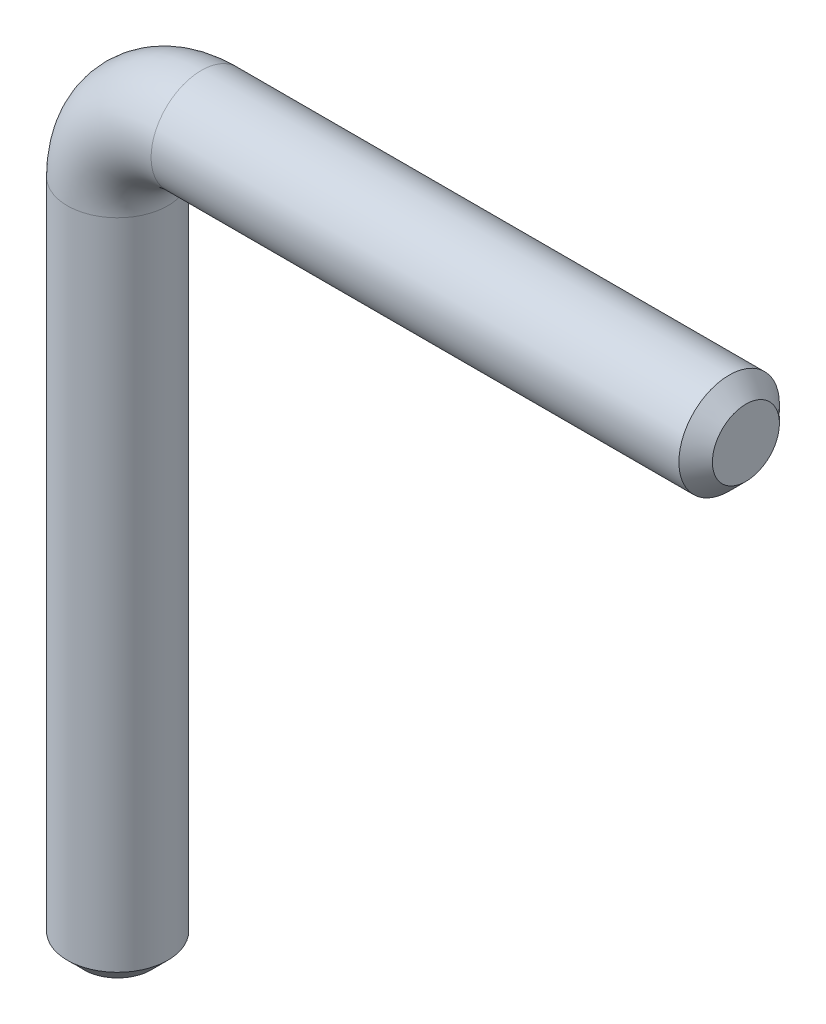
ISO-10303-21;
HEADER;
FILE_DESCRIPTION(('STEP AP214'),'2;1');
FILE_NAME('part.step','',(''),(''),'','','');
FILE_SCHEMA(('AUTOMOTIVE_DESIGN { 1 0 10303 214 1 1 1 1 }'));
ENDSEC;
DATA;
#1=APPLICATION_CONTEXT('core data for automotive mechanical design processes');
#2=APPLICATION_PROTOCOL_DEFINITION('international standard','automotive_design',2000,#1);
#3=PRODUCT_CONTEXT('',#1,'mechanical');
#4=PRODUCT('Part','Part','',(#3));
#5=PRODUCT_RELATED_PRODUCT_CATEGORY('part','',(#4));
#6=PRODUCT_DEFINITION_FORMATION('','',#4);
#7=PRODUCT_DEFINITION_CONTEXT('part definition',#1,'design');
#8=PRODUCT_DEFINITION('design','',#6,#7);
#9=PRODUCT_DEFINITION_SHAPE('','',#8);
#10=(LENGTH_UNIT() NAMED_UNIT(*) SI_UNIT(.MILLI.,.METRE.));
#11=(NAMED_UNIT(*) PLANE_ANGLE_UNIT() SI_UNIT($,.RADIAN.));
#12=(NAMED_UNIT(*) SI_UNIT($,.STERADIAN.) SOLID_ANGLE_UNIT());
#13=UNCERTAINTY_MEASURE_WITH_UNIT(LENGTH_MEASURE(1.E-05),#10,'distance_accuracy_value','');
#14=(GEOMETRIC_REPRESENTATION_CONTEXT(3) GLOBAL_UNCERTAINTY_ASSIGNED_CONTEXT((#13)) GLOBAL_UNIT_ASSIGNED_CONTEXT((#10,
#11,#12)) REPRESENTATION_CONTEXT('',''));
#15=CARTESIAN_POINT('',(0.,0.,0.));
#16=DIRECTION('',(0.,0.,1.));
#17=DIRECTION('',(1.,0.,0.));
#18=AXIS2_PLACEMENT_3D('',#15,#16,#17);
#19=CARTESIAN_POINT('',(75.,90.,0.));
#20=DIRECTION('',(1.,0.,0.));
#21=DIRECTION('',(0.,1.,0.));
#22=AXIS2_PLACEMENT_3D('',#19,#20,#21);
#23=PLANE('',#22);
#24=CARTESIAN_POINT('',(75.,90.,0.));
#25=DIRECTION('',(1.,0.,0.));
#26=DIRECTION('',(0.,1.,0.));
#27=AXIS2_PLACEMENT_3D('',#24,#25,#26);
#28=CIRCLE('',#27,3.99999999999999);
#29=CARTESIAN_POINT('',(75.,94.,0.));
#30=VERTEX_POINT('',#29);
#31=EDGE_CURVE('E80',#30,#30,#28,.T.);
#32=ORIENTED_EDGE('',*,*,#31,.T.);
#33=EDGE_LOOP('',(#32));
#34=FACE_BOUND('',#33,.T.);
#35=ADVANCED_FACE('F64',(#34),#23,.T.);
#36=CARTESIAN_POINT('',(0.,0.,0.));
#37=DIRECTION('',(0.,1.,0.));
#38=DIRECTION('',(-1.,0.,0.));
#39=AXIS2_PLACEMENT_3D('',#36,#37,#38);
#40=PLANE('',#39);
#41=CARTESIAN_POINT('',(0.,0.,0.));
#42=DIRECTION('',(0.,1.,0.));
#43=DIRECTION('',(-1.,0.,0.));
#44=AXIS2_PLACEMENT_3D('',#41,#42,#43);
#45=CIRCLE('',#44,3.99999999999999);
#46=CARTESIAN_POINT('',(-3.99999999999999,0.,0.));
#47=VERTEX_POINT('',#46);
#48=EDGE_CURVE('E13',#47,#47,#45,.F.);
#49=ORIENTED_EDGE('',*,*,#48,.T.);
#50=EDGE_LOOP('',(#49));
#51=FACE_BOUND('',#50,.T.);
#52=ADVANCED_FACE('F105',(#51),#40,.F.);
#53=CARTESIAN_POINT('',(75.,90.,0.));
#54=DIRECTION('',(-1.,0.,0.));
#55=DIRECTION('',(0.,-1.,0.));
#56=AXIS2_PLACEMENT_3D('',#53,#54,#55);
#57=CYLINDRICAL_SURFACE('',#56,6.);
#58=CARTESIAN_POINT('',(73.,90.,0.));
#59=DIRECTION('',(1.,0.,0.));
#60=DIRECTION('',(0.,0.,-1.));
#61=AXIS2_PLACEMENT_3D('',#58,#59,#60);
#62=CIRCLE('',#61,6.);
#63=CARTESIAN_POINT('',(73.,90.,-6.));
#64=VERTEX_POINT('',#63);
#65=EDGE_CURVE('E76',#64,#64,#62,.F.);
#66=ORIENTED_EDGE('',*,*,#65,.T.);
#67=EDGE_LOOP('',(#66));
#68=FACE_BOUND('',#67,.T.);
#69=CARTESIAN_POINT('',(9.99999999999999,90.,0.));
#70=DIRECTION('',(1.,0.,0.));
#71=DIRECTION('',(0.,1.,0.));
#72=AXIS2_PLACEMENT_3D('',#69,#70,#71);
#73=CIRCLE('',#72,6.);
#74=CARTESIAN_POINT('',(9.99999999999999,96.,0.));
#75=VERTEX_POINT('',#74);
#76=EDGE_CURVE('E88',#75,#75,#73,.T.);
#77=ORIENTED_EDGE('',*,*,#76,.T.);
#78=EDGE_LOOP('',(#77));
#79=FACE_BOUND('',#78,.T.);
#80=ADVANCED_FACE('F92',(#68,#79),#57,.T.);
#81=CARTESIAN_POINT('',(9.99999999999999,80.,0.));
#82=DIRECTION('',(0.,0.,1.));
#83=DIRECTION('',(1.,0.,0.));
#84=AXIS2_PLACEMENT_3D('',#81,#82,#83);
#85=TOROIDAL_SURFACE('',#84,9.99999999999999,6.);
#86=CARTESIAN_POINT('',(0.,80.,0.));
#87=DIRECTION('',(0.,1.,0.));
#88=DIRECTION('',(-1.,0.,0.));
#89=AXIS2_PLACEMENT_3D('',#86,#87,#88);
#90=CIRCLE('',#89,6.);
#91=CARTESIAN_POINT('',(-5.99999999999999,80.,0.));
#92=VERTEX_POINT('',#91);
#93=EDGE_CURVE('E85',#92,#92,#90,.T.);
#94=CARTESIAN_POINT('',(9.99999999999999,80.,0.));
#95=DIRECTION('',(0.,0.,1.));
#96=DIRECTION('',(1.,0.,0.));
#97=AXIS2_PLACEMENT_3D('',#94,#95,#96);
#98=CIRCLE('',#97,16.);
#99=EDGE_CURVE('',#75,#92,#98,.T.);
#100=ORIENTED_EDGE('',*,*,#76,.F.);
#101=ORIENTED_EDGE('',*,*,#93,.T.);
#102=ORIENTED_EDGE('',*,*,#99,.T.);
#103=ORIENTED_EDGE('',*,*,#99,.F.);
#104=EDGE_LOOP('',(#100,#102,#101,#103));
#105=FACE_BOUND('',#104,.T.);
#106=ADVANCED_FACE('F94',(#105),#85,.T.);
#107=CARTESIAN_POINT('',(0.,80.,0.));
#108=DIRECTION('',(0.,-1.,0.));
#109=DIRECTION('',(1.,0.,0.));
#110=AXIS2_PLACEMENT_3D('',#107,#108,#109);
#111=CYLINDRICAL_SURFACE('',#110,6.);
#112=CARTESIAN_POINT('',(0.,2.,0.));
#113=DIRECTION('',(0.,1.,0.));
#114=DIRECTION('',(-1.,0.,0.));
#115=AXIS2_PLACEMENT_3D('',#112,#113,#114);
#116=CIRCLE('',#115,6.);
#117=CARTESIAN_POINT('',(-6.,2.,0.));
#118=VERTEX_POINT('',#117);
#119=EDGE_CURVE('E72',#118,#118,#116,.T.);
#120=ORIENTED_EDGE('',*,*,#119,.T.);
#121=EDGE_LOOP('',(#120));
#122=FACE_BOUND('',#121,.T.);
#123=ORIENTED_EDGE('',*,*,#93,.F.);
#124=EDGE_LOOP('',(#123));
#125=FACE_BOUND('',#124,.T.);
#126=ADVANCED_FACE('F96',(#122,#125),#111,.T.);
#127=CARTESIAN_POINT('',(75.,90.,0.));
#128=DIRECTION('',(-1.,0.,0.));
#129=DIRECTION('',(0.,0.,1.));
#130=AXIS2_PLACEMENT_3D('',#127,#128,#129);
#131=CONICAL_SURFACE('',#130,3.99999999999999,0.785398163397454);
#132=ORIENTED_EDGE('',*,*,#65,.F.);
#133=EDGE_LOOP('',(#132));
#134=FACE_BOUND('',#133,.T.);
#135=ORIENTED_EDGE('',*,*,#31,.F.);
#136=EDGE_LOOP('',(#135));
#137=FACE_BOUND('',#136,.T.);
#138=ADVANCED_FACE('F103',(#134,#137),#131,.T.);
#139=CARTESIAN_POINT('',(0.,2.,0.));
#140=DIRECTION('',(0.,1.,0.));
#141=DIRECTION('',(-1.,0.,0.));
#142=AXIS2_PLACEMENT_3D('',#139,#140,#141);
#143=CONICAL_SURFACE('',#142,6.,0.78539816339745);
#144=ORIENTED_EDGE('',*,*,#48,.F.);
#145=EDGE_LOOP('',(#144));
#146=FACE_BOUND('',#145,.T.);
#147=ORIENTED_EDGE('',*,*,#119,.F.);
#148=EDGE_LOOP('',(#147));
#149=FACE_BOUND('',#148,.T.);
#150=ADVANCED_FACE('F67',(#146,#149),#143,.T.);
#151=CLOSED_SHELL('',(#35,#52,#80,#106,#126,#138,#150));
#152=MANIFOLD_SOLID_BREP('B2',#151);
#153=ADVANCED_BREP_SHAPE_REPRESENTATION('',(#18,#152),#14);
#154=SHAPE_DEFINITION_REPRESENTATION(#9,#153);
ENDSEC;
END-ISO-10303-21;
